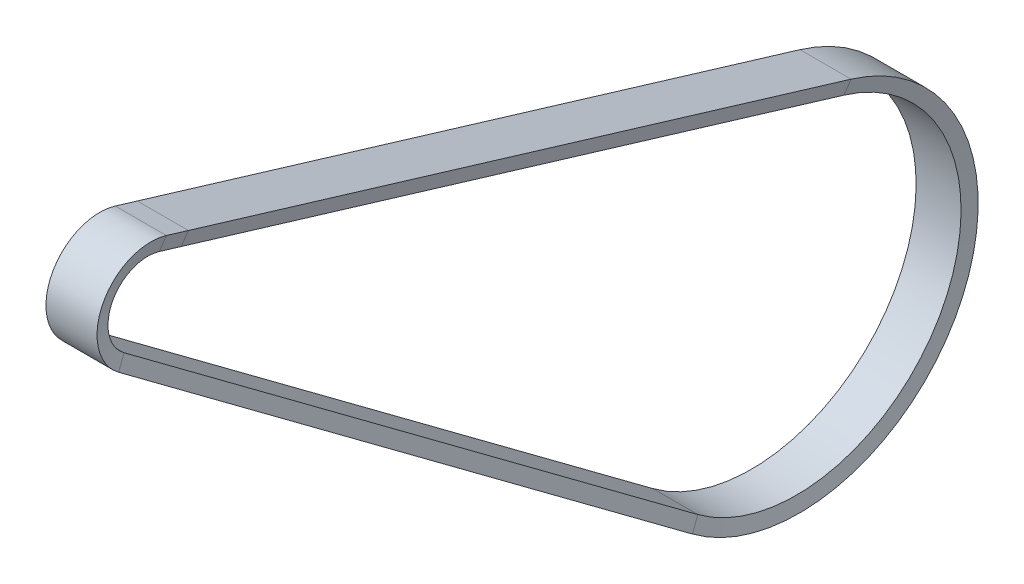
ISO-10303-21;
HEADER;
FILE_DESCRIPTION(('STEP AP214'),'2;1');
FILE_NAME('part.step','',(''),(''),'','','');
FILE_SCHEMA(('AUTOMOTIVE_DESIGN { 1 0 10303 214 1 1 1 1 }'));
ENDSEC;
DATA;
#1=APPLICATION_CONTEXT('core data for automotive mechanical design processes');
#2=APPLICATION_PROTOCOL_DEFINITION('international standard','automotive_design',2000,#1);
#3=PRODUCT_CONTEXT('',#1,'mechanical');
#4=PRODUCT('Part','Part','',(#3));
#5=PRODUCT_RELATED_PRODUCT_CATEGORY('part','',(#4));
#6=PRODUCT_DEFINITION_FORMATION('','',#4);
#7=PRODUCT_DEFINITION_CONTEXT('part definition',#1,'design');
#8=PRODUCT_DEFINITION('design','',#6,#7);
#9=PRODUCT_DEFINITION_SHAPE('','',#8);
#10=(LENGTH_UNIT() NAMED_UNIT(*) SI_UNIT(.MILLI.,.METRE.));
#11=(NAMED_UNIT(*) PLANE_ANGLE_UNIT() SI_UNIT($,.RADIAN.));
#12=(NAMED_UNIT(*) SI_UNIT($,.STERADIAN.) SOLID_ANGLE_UNIT());
#13=UNCERTAINTY_MEASURE_WITH_UNIT(LENGTH_MEASURE(1.E-05),#10,'distance_accuracy_value','');
#14=(GEOMETRIC_REPRESENTATION_CONTEXT(3) GLOBAL_UNCERTAINTY_ASSIGNED_CONTEXT((#13)) GLOBAL_UNIT_ASSIGNED_CONTEXT((#10,
#11,#12)) REPRESENTATION_CONTEXT('',''));
#15=CARTESIAN_POINT('',(0.,0.,0.));
#16=DIRECTION('',(0.,0.,1.));
#17=DIRECTION('',(1.,0.,0.));
#18=AXIS2_PLACEMENT_3D('',#15,#16,#17);
#19=CARTESIAN_POINT('',(8.355,85.4935565680425,-13.1454803731196));
#20=DIRECTION('',(-0.97666087498056,0.205603293377556,-0.0621355054257192));
#21=DIRECTION('',(-0.206001345113913,-0.978551708297144,0.));
#22=AXIS2_PLACEMENT_3D('',#19,#20,#21);
#23=PLANE('',#22);
#24=DIRECTION('',(0.214787186028604,0.934900240424163,-0.282538502106803));
#25=VECTOR('',#24,1.);
#26=CARTESIAN_POINT('',(8.355,85.4935565680425,-13.1454803731197));
#27=LINE('',#26,#25);
#28=CARTESIAN_POINT('',(8.355,85.4935565680425,-13.1454803731197));
#29=VERTEX_POINT('',#28);
#30=CARTESIAN_POINT('',(9.5002898876939,90.4786388309005,-14.6520343502457));
#31=VERTEX_POINT('',#30);
#32=EDGE_CURVE('E168',#29,#31,#27,.T.);
#33=ORIENTED_EDGE('',*,*,#32,.F.);
#34=DIRECTION('',(0.,-0.289288698150564,-0.957241896869518));
#35=VECTOR('',#34,1.);
#36=CARTESIAN_POINT('',(8.355,85.4935565680425,-13.1454803731196));
#37=LINE('',#36,#35);
#38=CARTESIAN_POINT('',(8.355,83.0173584034913,-21.3390967957916));
#39=VERTEX_POINT('',#38);
#40=EDGE_CURVE('E167',#29,#39,#37,.T.);
#41=ORIENTED_EDGE('',*,*,#40,.T.);
#42=DIRECTION('',(0.214787186028604,0.934900240424163,-0.282538502106803));
#43=VECTOR('',#42,1.);
#44=CARTESIAN_POINT('',(8.355,83.0173584034913,-21.3390967957916));
#45=LINE('',#44,#43);
#46=CARTESIAN_POINT('',(9.5002898876939,88.0024406663493,-22.8456507729176));
#47=VERTEX_POINT('',#46);
#48=EDGE_CURVE('E142',#39,#47,#45,.T.);
#49=ORIENTED_EDGE('',*,*,#48,.T.);
#50=DIRECTION('',(0.,-0.289288698150564,-0.957241896869518));
#51=VECTOR('',#50,1.);
#52=CARTESIAN_POINT('',(9.5002898876939,90.4786388309006,-14.6520343502457));
#53=LINE('',#52,#51);
#54=EDGE_CURVE('E172',#31,#47,#53,.T.);
#55=ORIENTED_EDGE('',*,*,#54,.F.);
#56=EDGE_LOOP('',(#33,#41,#49,#55));
#57=FACE_BOUND('',#56,.T.);
#58=ADVANCED_FACE('F34',(#57),#23,.F.);
#59=CARTESIAN_POINT('',(8.355,83.0173584034913,-21.3390967957916));
#60=DIRECTION('',(-0.97666087498056,0.205603293377556,-0.0621355054257192));
#61=DIRECTION('',(-0.206001345113913,-0.978551708297144,0.));
#62=AXIS2_PLACEMENT_3D('',#59,#60,#61);
#63=PLANE('',#62);
#64=DIRECTION('',(0.,-0.289288698150564,-0.957241896869518));
#65=VECTOR('',#64,1.);
#66=CARTESIAN_POINT('',(9.5002898876939,88.0024406663493,-22.8456507729176));
#67=LINE('',#66,#65);
#68=CARTESIAN_POINT('',(9.5002898876939,13.5386110579518,-269.242754974384));
#69=VERTEX_POINT('',#68);
#70=EDGE_CURVE('E148',#47,#69,#67,.T.);
#71=ORIENTED_EDGE('',*,*,#70,.F.);
#72=ORIENTED_EDGE('',*,*,#48,.F.);
#73=DIRECTION('',(0.,-0.289288698150564,-0.957241896869518));
#74=VECTOR('',#73,1.);
#75=CARTESIAN_POINT('',(8.355,83.0173584034913,-21.3390967957916));
#76=LINE('',#75,#74);
#77=CARTESIAN_POINT('',(8.355,8.55352879509376,-267.736200997258));
#78=VERTEX_POINT('',#77);
#79=EDGE_CURVE('E146',#39,#78,#76,.T.);
#80=ORIENTED_EDGE('',*,*,#79,.T.);
#81=DIRECTION('',(0.214787186028604,0.934900240424163,-0.282538502106803));
#82=VECTOR('',#81,1.);
#83=CARTESIAN_POINT('',(8.355,8.55352879509376,-267.736200997258));
#84=LINE('',#83,#82);
#85=EDGE_CURVE('E164',#78,#69,#84,.T.);
#86=ORIENTED_EDGE('',*,*,#85,.T.);
#87=EDGE_LOOP('',(#71,#72,#80,#86));
#88=FACE_BOUND('',#87,.T.);
#89=ADVANCED_FACE('F144',(#88),#63,.F.);
#90=CARTESIAN_POINT('',(9.5002898876939,88.0024406663493,-22.8456507729176));
#91=DIRECTION('',(0.,-0.957241896869518,0.289288698150564));
#92=DIRECTION('',(0.,-0.289288698150564,-0.957241896869518));
#93=AXIS2_PLACEMENT_3D('',#90,#91,#92);
#94=PLANE('',#93);
#95=DIRECTION('',(0.,-0.289288698150564,-0.957241896869518));
#96=VECTOR('',#95,1.);
#97=CARTESIAN_POINT('',(-9.4997101123061,88.0024406663493,-22.8456507729176));
#98=LINE('',#97,#96);
#99=CARTESIAN_POINT('',(-9.4997101123061,88.0024406663493,-22.8456507729176));
#100=VERTEX_POINT('',#99);
#101=CARTESIAN_POINT('',(-9.4997101123061,13.5386110579518,-269.242754974384));
#102=VERTEX_POINT('',#101);
#103=EDGE_CURVE('E209',#100,#102,#98,.T.);
#104=ORIENTED_EDGE('',*,*,#103,.F.);
#105=DIRECTION('',(-1.,0.,0.));
#106=VECTOR('',#105,1.);
#107=CARTESIAN_POINT('',(9.5002898876939,88.0024406663493,-22.8456507729176));
#108=LINE('',#107,#106);
#109=EDGE_CURVE('E153',#47,#100,#108,.T.);
#110=ORIENTED_EDGE('',*,*,#109,.F.);
#111=ORIENTED_EDGE('',*,*,#70,.T.);
#112=DIRECTION('',(-1.,0.,0.));
#113=VECTOR('',#112,1.);
#114=CARTESIAN_POINT('',(9.5002898876939,13.5386110579518,-269.242754974384));
#115=LINE('',#114,#113);
#116=EDGE_CURVE('E241',#69,#102,#115,.T.);
#117=ORIENTED_EDGE('',*,*,#116,.T.);
#118=EDGE_LOOP('',(#104,#110,#111,#117));
#119=FACE_BOUND('',#118,.T.);
#120=ADVANCED_FACE('F259',(#119),#94,.F.);
#121=CARTESIAN_POINT('',(-9.4997101123061,88.0024406663493,-22.8456507729176));
#122=DIRECTION('',(0.976683678934043,0.205504009848043,-0.0621055008854931));
#123=DIRECTION('',(-0.205901484103399,0.978572725373039,0.));
#124=AXIS2_PLACEMENT_3D('',#121,#122,#123);
#125=PLANE('',#124);
#126=DIRECTION('',(0.,-0.289288698150564,-0.957241896869518));
#127=VECTOR('',#126,1.);
#128=CARTESIAN_POINT('',(-8.355,83.0173584034913,-21.3390967957916));
#129=LINE('',#128,#127);
#130=CARTESIAN_POINT('',(-8.355,83.0173584034913,-21.3390967957916));
#131=VERTEX_POINT('',#130);
#132=CARTESIAN_POINT('',(-8.355,8.55352879509376,-267.736200997258));
#133=VERTEX_POINT('',#132);
#134=EDGE_CURVE('E183',#131,#133,#129,.T.);
#135=ORIENTED_EDGE('',*,*,#134,.F.);
#136=DIRECTION('',(0.214683467700105,-0.934922069312921,0.282545099068987));
#137=VECTOR('',#136,1.);
#138=CARTESIAN_POINT('',(-9.4997101123061,88.0024406663493,-22.8456507729176));
#139=LINE('',#138,#137);
#140=EDGE_CURVE('E175',#100,#131,#139,.T.);
#141=ORIENTED_EDGE('',*,*,#140,.F.);
#142=ORIENTED_EDGE('',*,*,#103,.T.);
#143=DIRECTION('',(0.214683467700105,-0.934922069312921,0.282545099068987));
#144=VECTOR('',#143,1.);
#145=CARTESIAN_POINT('',(-9.4997101123061,13.5386110579518,-269.242754974384));
#146=LINE('',#145,#144);
#147=EDGE_CURVE('E211',#102,#133,#146,.T.);
#148=ORIENTED_EDGE('',*,*,#147,.T.);
#149=EDGE_LOOP('',(#135,#141,#142,#148));
#150=FACE_BOUND('',#149,.T.);
#151=ADVANCED_FACE('F207',(#150),#125,.F.);
#152=CARTESIAN_POINT('',(-8.355,83.0173584034913,-21.3390967957916));
#153=DIRECTION('',(0.,0.957241896869518,-0.289288698150564));
#154=DIRECTION('',(0.,0.289288698150564,0.957241896869518));
#155=AXIS2_PLACEMENT_3D('',#152,#153,#154);
#156=PLANE('',#155);
#157=DIRECTION('',(1.,0.,0.));
#158=VECTOR('',#157,1.);
#159=CARTESIAN_POINT('',(-8.355,8.55352879509376,-267.736200997258));
#160=LINE('',#159,#158);
#161=EDGE_CURVE('E162',#133,#78,#160,.T.);
#162=ORIENTED_EDGE('',*,*,#161,.T.);
#163=ORIENTED_EDGE('',*,*,#79,.F.);
#164=DIRECTION('',(1.,0.,0.));
#165=VECTOR('',#164,1.);
#166=CARTESIAN_POINT('',(-8.355,83.0173584034913,-21.3390967957916));
#167=LINE('',#166,#165);
#168=EDGE_CURVE('E160',#131,#39,#167,.T.);
#169=ORIENTED_EDGE('',*,*,#168,.F.);
#170=ORIENTED_EDGE('',*,*,#134,.T.);
#171=EDGE_LOOP('',(#162,#163,#169,#170));
#172=FACE_BOUND('',#171,.T.);
#173=ADVANCED_FACE('F158',(#172),#156,.F.);
#174=CARTESIAN_POINT('',(8.355,-50.1332345006582,-250.000435974857));
#175=DIRECTION('',(1.,0.,0.));
#176=DIRECTION('',(0.,0.,-1.));
#177=AXIS2_PLACEMENT_3D('',#174,#175,#176);
#178=CONICAL_SURFACE('',#177,61.3081849923926,1.354322401732);
#179=CARTESIAN_POINT('',(9.5002898876939,-50.1332345006582,-250.000435974857));
#180=DIRECTION('',(-1.,0.,0.));
#181=DIRECTION('',(0.,0.957241859341531,-0.289288822328774));
#182=AXIS2_PLACEMENT_3D('',#179,#180,#181);
#183=CIRCLE('',#182,66.5159436324783);
#184=CARTESIAN_POINT('',(9.5002898876939,-103.494162302761,-210.289201526432));
#185=VERTEX_POINT('',#184);
#186=EDGE_CURVE('E127',#69,#185,#183,.T.);
#187=ORIENTED_EDGE('',*,*,#186,.F.);
#188=ORIENTED_EDGE('',*,*,#85,.F.);
#189=CARTESIAN_POINT('',(8.355,-50.1332345006582,-250.000435974857));
#190=DIRECTION('',(-1.,0.,0.));
#191=DIRECTION('',(0.,0.957241896869628,-0.289288698150197));
#192=AXIS2_PLACEMENT_3D('',#189,#190,#191);
#193=CIRCLE('',#192,61.3081849923926);
#194=CARTESIAN_POINT('',(8.355,-99.3163591807403,-213.39833502744));
#195=VERTEX_POINT('',#194);
#196=EDGE_CURVE('E182',#78,#195,#193,.T.);
#197=ORIENTED_EDGE('',*,*,#196,.T.);
#198=DIRECTION('',(0.214787186028604,-0.783503448342792,0.583085595048332));
#199=VECTOR('',#198,1.);
#200=CARTESIAN_POINT('',(8.355,-99.3163591807402,-213.39833502744));
#201=LINE('',#200,#199);
#202=EDGE_CURVE('E218',#195,#185,#201,.T.);
#203=ORIENTED_EDGE('',*,*,#202,.T.);
#204=EDGE_LOOP('',(#187,#188,#197,#203));
#205=FACE_BOUND('',#204,.T.);
#206=ADVANCED_FACE('F284',(#205),#178,.F.);
#207=CARTESIAN_POINT('',(0.,-50.1332345006582,-250.000435974857));
#208=DIRECTION('',(-1.,0.,0.));
#209=DIRECTION('',(0.,0.,1.));
#210=AXIS2_PLACEMENT_3D('',#207,#208,#209);
#211=CYLINDRICAL_SURFACE('',#210,66.5159436324783);
#212=CARTESIAN_POINT('',(-9.4997101123061,-50.1332345006582,-250.000435974857));
#213=DIRECTION('',(-1.,0.,0.));
#214=DIRECTION('',(0.,0.957241859341531,-0.289288822328774));
#215=AXIS2_PLACEMENT_3D('',#212,#213,#214);
#216=CIRCLE('',#215,66.5159436324783);
#217=CARTESIAN_POINT('',(-9.4997101123061,-103.494162302761,-210.289201526432));
#218=VERTEX_POINT('',#217);
#219=EDGE_CURVE('E121',#102,#218,#216,.T.);
#220=ORIENTED_EDGE('',*,*,#219,.F.);
#221=ORIENTED_EDGE('',*,*,#116,.F.);
#222=ORIENTED_EDGE('',*,*,#186,.T.);
#223=DIRECTION('',(-1.,0.,0.));
#224=VECTOR('',#223,1.);
#225=CARTESIAN_POINT('',(9.5002898876939,-103.494162302761,-210.289201526432));
#226=LINE('',#225,#224);
#227=EDGE_CURVE('E216',#185,#218,#226,.T.);
#228=ORIENTED_EDGE('',*,*,#227,.T.);
#229=EDGE_LOOP('',(#220,#221,#222,#228));
#230=FACE_BOUND('',#229,.T.);
#231=ADVANCED_FACE('F286',(#230),#211,.T.);
#232=CARTESIAN_POINT('',(-9.4997101123061,-50.1332345006582,-250.000435974857));
#233=DIRECTION('',(-1.,0.,0.));
#234=DIRECTION('',(0.,0.,1.));
#235=AXIS2_PLACEMENT_3D('',#232,#233,#234);
#236=CONICAL_SURFACE('',#235,66.5159436324783,1.35442859736266);
#237=CARTESIAN_POINT('',(-8.355,-50.1332345006582,-250.000435974857));
#238=DIRECTION('',(-1.,0.,0.));
#239=DIRECTION('',(0.,0.957241896869628,-0.289288698150197));
#240=AXIS2_PLACEMENT_3D('',#237,#238,#239);
#241=CIRCLE('',#240,61.3081849923926);
#242=CARTESIAN_POINT('',(-8.355,-99.3163591807403,-213.39833502744));
#243=VERTEX_POINT('',#242);
#244=EDGE_CURVE('E217',#133,#243,#241,.T.);
#245=ORIENTED_EDGE('',*,*,#244,.F.);
#246=ORIENTED_EDGE('',*,*,#147,.F.);
#247=ORIENTED_EDGE('',*,*,#219,.T.);
#248=DIRECTION('',(0.214683467700105,0.783521742283553,-0.583099209453421));
#249=VECTOR('',#248,1.);
#250=CARTESIAN_POINT('',(-9.4997101123061,-103.494162302761,-210.289201526432));
#251=LINE('',#250,#249);
#252=EDGE_CURVE('E187',#218,#243,#251,.T.);
#253=ORIENTED_EDGE('',*,*,#252,.T.);
#254=EDGE_LOOP('',(#245,#246,#247,#253));
#255=FACE_BOUND('',#254,.T.);
#256=ADVANCED_FACE('F292',(#255),#236,.F.);
#257=CARTESIAN_POINT('',(0.,-50.1332345006582,-250.000435974857));
#258=DIRECTION('',(-1.,0.,0.));
#259=DIRECTION('',(0.,0.,1.));
#260=AXIS2_PLACEMENT_3D('',#257,#258,#259);
#261=CYLINDRICAL_SURFACE('',#260,61.3081849923926);
#262=DIRECTION('',(1.,0.,0.));
#263=VECTOR('',#262,1.);
#264=CARTESIAN_POINT('',(-8.355,-99.3163591807402,-213.39833502744));
#265=LINE('',#264,#263);
#266=EDGE_CURVE('E184',#243,#195,#265,.T.);
#267=ORIENTED_EDGE('',*,*,#266,.T.);
#268=ORIENTED_EDGE('',*,*,#196,.F.);
#269=ORIENTED_EDGE('',*,*,#161,.F.);
#270=ORIENTED_EDGE('',*,*,#244,.T.);
#271=EDGE_LOOP('',(#267,#268,#269,#270));
#272=FACE_BOUND('',#271,.T.);
#273=ADVANCED_FACE('F282',(#272),#261,.F.);
#274=CARTESIAN_POINT('',(8.355,-99.3163591807402,-213.39833502744));
#275=DIRECTION('',(-0.97666087498056,-0.172308231787492,0.128231854624641));
#276=DIRECTION('',(0.173742613142672,-0.984791096821227,0.));
#277=AXIS2_PLACEMENT_3D('',#274,#275,#276);
#278=PLANE('',#277);
#279=DIRECTION('',(0.,0.597018178763213,0.802227707216758));
#280=VECTOR('',#279,1.);
#281=CARTESIAN_POINT('',(9.5002898876939,-103.494162302761,-210.289201526432));
#282=LINE('',#281,#280);
#283=CARTESIAN_POINT('',(9.5002898876939,55.2904551007498,3.07351353325508));
#284=VERTEX_POINT('',#283);
#285=EDGE_CURVE('E104',#185,#284,#282,.T.);
#286=ORIENTED_EDGE('',*,*,#285,.F.);
#287=ORIENTED_EDGE('',*,*,#202,.F.);
#288=DIRECTION('',(0.,0.597018178763213,0.802227707216758));
#289=VECTOR('',#288,1.);
#290=CARTESIAN_POINT('',(8.355,-99.3163591807402,-213.39833502744));
#291=LINE('',#290,#289);
#292=CARTESIAN_POINT('',(8.355,59.4682582227703,-0.0356199677531976));
#293=VERTEX_POINT('',#292);
#294=EDGE_CURVE('E186',#195,#293,#291,.T.);
#295=ORIENTED_EDGE('',*,*,#294,.T.);
#296=DIRECTION('',(0.214787186028604,-0.783503448342792,0.583085595048333));
#297=VECTOR('',#296,1.);
#298=CARTESIAN_POINT('',(8.355,59.4682582227703,-0.0356199677532046));
#299=LINE('',#298,#297);
#300=EDGE_CURVE('E247',#293,#284,#299,.T.);
#301=ORIENTED_EDGE('',*,*,#300,.T.);
#302=EDGE_LOOP('',(#286,#287,#295,#301));
#303=FACE_BOUND('',#302,.T.);
#304=ADVANCED_FACE('F278',(#303),#278,.F.);
#305=CARTESIAN_POINT('',(9.5002898876939,-103.494162302761,-210.289201526432));
#306=DIRECTION('',(0.,0.802227707216758,-0.597018178763213));
#307=DIRECTION('',(0.,0.597018178763213,0.802227707216758));
#308=AXIS2_PLACEMENT_3D('',#305,#306,#307);
#309=PLANE('',#308);
#310=DIRECTION('',(0.,0.597018178763213,0.802227707216758));
#311=VECTOR('',#310,1.);
#312=CARTESIAN_POINT('',(-9.4997101123061,-103.494162302761,-210.289201526432));
#313=LINE('',#312,#311);
#314=CARTESIAN_POINT('',(-9.4997101123061,55.2904551007498,3.07351353325508));
#315=VERTEX_POINT('',#314);
#316=EDGE_CURVE('E97',#218,#315,#313,.T.);
#317=ORIENTED_EDGE('',*,*,#316,.F.);
#318=ORIENTED_EDGE('',*,*,#227,.F.);
#319=ORIENTED_EDGE('',*,*,#285,.T.);
#320=DIRECTION('',(-1.,0.,0.));
#321=VECTOR('',#320,1.);
#322=CARTESIAN_POINT('',(9.5002898876939,55.2904551007498,3.07351353325509));
#323=LINE('',#322,#321);
#324=EDGE_CURVE('E226',#284,#315,#323,.T.);
#325=ORIENTED_EDGE('',*,*,#324,.T.);
#326=EDGE_LOOP('',(#317,#318,#319,#325));
#327=FACE_BOUND('',#326,.T.);
#328=ADVANCED_FACE('F281',(#327),#309,.F.);
#329=CARTESIAN_POINT('',(-9.4997101123061,-103.494162302761,-210.289201526432));
#330=DIRECTION('',(0.976683678934043,-0.172225026070623,0.128169932897055));
#331=DIRECTION('',(0.173657313172644,0.984806142132379,0.));
#332=AXIS2_PLACEMENT_3D('',#329,#330,#331);
#333=PLANE('',#332);
#334=DIRECTION('',(0.,0.597018178763213,0.802227707216758));
#335=VECTOR('',#334,1.);
#336=CARTESIAN_POINT('',(-8.355,-99.3163591807402,-213.39833502744));
#337=LINE('',#336,#335);
#338=CARTESIAN_POINT('',(-8.355,59.4682582227703,-0.0356199677531976));
#339=VERTEX_POINT('',#338);
#340=EDGE_CURVE('E88',#243,#339,#337,.T.);
#341=ORIENTED_EDGE('',*,*,#340,.F.);
#342=ORIENTED_EDGE('',*,*,#252,.F.);
#343=ORIENTED_EDGE('',*,*,#316,.T.);
#344=DIRECTION('',(0.214683467700105,0.783521742283552,-0.583099209453421));
#345=VECTOR('',#344,1.);
#346=CARTESIAN_POINT('',(-9.4997101123061,55.2904551007498,3.07351353325509));
#347=LINE('',#346,#345);
#348=EDGE_CURVE('E193',#315,#339,#347,.T.);
#349=ORIENTED_EDGE('',*,*,#348,.T.);
#350=EDGE_LOOP('',(#341,#342,#343,#349));
#351=FACE_BOUND('',#350,.T.);
#352=ADVANCED_FACE('F295',(#351),#333,.F.);
#353=CARTESIAN_POINT('',(-8.355,-99.3163591807402,-213.39833502744));
#354=DIRECTION('',(0.,-0.802227707216758,0.597018178763213));
#355=DIRECTION('',(0.,-0.597018178763213,-0.802227707216758));
#356=AXIS2_PLACEMENT_3D('',#353,#354,#355);
#357=PLANE('',#356);
#358=DIRECTION('',(1.,0.,0.));
#359=VECTOR('',#358,1.);
#360=CARTESIAN_POINT('',(-8.355,59.4682582227703,-0.0356199677532046));
#361=LINE('',#360,#359);
#362=EDGE_CURVE('E188',#339,#293,#361,.T.);
#363=ORIENTED_EDGE('',*,*,#362,.T.);
#364=ORIENTED_EDGE('',*,*,#294,.F.);
#365=ORIENTED_EDGE('',*,*,#266,.F.);
#366=ORIENTED_EDGE('',*,*,#340,.T.);
#367=EDGE_LOOP('',(#363,#364,#365,#366));
#368=FACE_BOUND('',#367,.T.);
#369=ADVANCED_FACE('F277',(#368),#357,.F.);
#370=CARTESIAN_POINT('',(8.355,71.3344566343139,-8.86644954487858));
#371=DIRECTION('',(1.,0.,0.));
#372=DIRECTION('',(0.,0.,-1.));
#373=AXIS2_PLACEMENT_3D('',#370,#371,#372);
#374=CONICAL_SURFACE('',#373,14.7915589361754,1.35432240173205);
#375=CARTESIAN_POINT('',(9.5002898876939,71.3344566343139,-8.86644954487858));
#376=DIRECTION('',(-1.,0.,0.));
#377=DIRECTION('',(0.,-0.802227449630928,0.597018524887341));
#378=AXIS2_PLACEMENT_3D('',#375,#376,#377);
#379=CIRCLE('',#378,19.9993175762624);
#380=EDGE_CURVE('E231',#284,#31,#379,.T.);
#381=ORIENTED_EDGE('',*,*,#380,.F.);
#382=ORIENTED_EDGE('',*,*,#300,.F.);
#383=CARTESIAN_POINT('',(8.355,71.3344566343139,-8.86644954487858));
#384=DIRECTION('',(-1.,0.,0.));
#385=DIRECTION('',(0.,-0.802227707217704,0.597018178761942));
#386=AXIS2_PLACEMENT_3D('',#383,#384,#385);
#387=CIRCLE('',#386,14.7915589361754);
#388=EDGE_CURVE('E189',#293,#29,#387,.T.);
#389=ORIENTED_EDGE('',*,*,#388,.T.);
#390=ORIENTED_EDGE('',*,*,#32,.T.);
#391=EDGE_LOOP('',(#381,#382,#389,#390));
#392=FACE_BOUND('',#391,.T.);
#393=ADVANCED_FACE('F274',(#392),#374,.F.);
#394=CARTESIAN_POINT('',(0.,71.3344566343139,-8.86644954487858));
#395=DIRECTION('',(-1.,0.,0.));
#396=DIRECTION('',(0.,0.,1.));
#397=AXIS2_PLACEMENT_3D('',#394,#395,#396);
#398=CYLINDRICAL_SURFACE('',#397,19.9993175762624);
#399=CARTESIAN_POINT('',(-9.4997101123061,71.3344566343139,-8.86644954487858));
#400=DIRECTION('',(-1.,0.,0.));
#401=DIRECTION('',(0.,-0.802227449630928,0.597018524887341));
#402=AXIS2_PLACEMENT_3D('',#399,#400,#401);
#403=CIRCLE('',#402,19.9993175762624);
#404=CARTESIAN_POINT('',(-9.4997101123061,90.4786388309005,-14.6520343502457));
#405=VERTEX_POINT('',#404);
#406=EDGE_CURVE('E59',#315,#405,#403,.T.);
#407=ORIENTED_EDGE('',*,*,#406,.F.);
#408=ORIENTED_EDGE('',*,*,#324,.F.);
#409=ORIENTED_EDGE('',*,*,#380,.T.);
#410=DIRECTION('',(-1.,0.,0.));
#411=VECTOR('',#410,1.);
#412=CARTESIAN_POINT('',(9.5002898876939,90.4786388309006,-14.6520343502457));
#413=LINE('',#412,#411);
#414=EDGE_CURVE('E229',#31,#405,#413,.T.);
#415=ORIENTED_EDGE('',*,*,#414,.T.);
#416=EDGE_LOOP('',(#407,#408,#409,#415));
#417=FACE_BOUND('',#416,.T.);
#418=ADVANCED_FACE('F255',(#417),#398,.T.);
#419=CARTESIAN_POINT('',(-9.4997101123061,71.3344566343139,-8.86644954487858));
#420=DIRECTION('',(-1.,0.,0.));
#421=DIRECTION('',(0.,0.,1.));
#422=AXIS2_PLACEMENT_3D('',#419,#420,#421);
#423=CONICAL_SURFACE('',#422,19.9993175762624,1.35442859736272);
#424=CARTESIAN_POINT('',(-8.355,71.3344566343139,-8.86644954487858));
#425=DIRECTION('',(-1.,0.,0.));
#426=DIRECTION('',(0.,-0.802227707217704,0.597018178761942));
#427=AXIS2_PLACEMENT_3D('',#424,#425,#426);
#428=CIRCLE('',#427,14.7915589361754);
#429=CARTESIAN_POINT('',(-8.355,85.4935565680425,-13.1454803731197));
#430=VERTEX_POINT('',#429);
#431=EDGE_CURVE('E51',#339,#430,#428,.T.);
#432=ORIENTED_EDGE('',*,*,#431,.F.);
#433=ORIENTED_EDGE('',*,*,#348,.F.);
#434=ORIENTED_EDGE('',*,*,#406,.T.);
#435=DIRECTION('',(0.214683467700105,-0.934922069312921,0.282545099068987));
#436=VECTOR('',#435,1.);
#437=CARTESIAN_POINT('',(-9.4997101123061,90.4786388309006,-14.6520343502457));
#438=LINE('',#437,#436);
#439=EDGE_CURVE('E198',#405,#430,#438,.T.);
#440=ORIENTED_EDGE('',*,*,#439,.T.);
#441=EDGE_LOOP('',(#432,#433,#434,#440));
#442=FACE_BOUND('',#441,.T.);
#443=ADVANCED_FACE('F304',(#442),#423,.F.);
#444=CARTESIAN_POINT('',(0.,71.3344566343139,-8.86644954487858));
#445=DIRECTION('',(-1.,0.,0.));
#446=DIRECTION('',(0.,0.,1.));
#447=AXIS2_PLACEMENT_3D('',#444,#445,#446);
#448=CYLINDRICAL_SURFACE('',#447,14.7915589361754);
#449=DIRECTION('',(1.,0.,0.));
#450=VECTOR('',#449,1.);
#451=CARTESIAN_POINT('',(-8.355,85.4935565680425,-13.1454803731197));
#452=LINE('',#451,#450);
#453=EDGE_CURVE('E38',#430,#29,#452,.T.);
#454=ORIENTED_EDGE('',*,*,#453,.T.);
#455=ORIENTED_EDGE('',*,*,#388,.F.);
#456=ORIENTED_EDGE('',*,*,#362,.F.);
#457=ORIENTED_EDGE('',*,*,#431,.T.);
#458=EDGE_LOOP('',(#454,#455,#456,#457));
#459=FACE_BOUND('',#458,.T.);
#460=ADVANCED_FACE('F199',(#459),#448,.F.);
#461=CARTESIAN_POINT('',(9.5002898876939,90.4786388309006,-14.6520343502457));
#462=DIRECTION('',(0.,-0.957241896869518,0.289288698150564));
#463=DIRECTION('',(0.,-0.289288698150564,-0.957241896869518));
#464=AXIS2_PLACEMENT_3D('',#461,#462,#463);
#465=PLANE('',#464);
#466=ORIENTED_EDGE('',*,*,#54,.T.);
#467=ORIENTED_EDGE('',*,*,#109,.T.);
#468=DIRECTION('',(0.,-0.289288698150564,-0.957241896869518));
#469=VECTOR('',#468,1.);
#470=CARTESIAN_POINT('',(-9.4997101123061,90.4786388309006,-14.6520343502457));
#471=LINE('',#470,#469);
#472=EDGE_CURVE('E43',#405,#100,#471,.T.);
#473=ORIENTED_EDGE('',*,*,#472,.F.);
#474=ORIENTED_EDGE('',*,*,#414,.F.);
#475=EDGE_LOOP('',(#466,#467,#473,#474));
#476=FACE_BOUND('',#475,.T.);
#477=ADVANCED_FACE('F258',(#476),#465,.F.);
#478=CARTESIAN_POINT('',(-9.4997101123061,90.4786388309006,-14.6520343502457));
#479=DIRECTION('',(0.976683678934043,0.205504009848043,-0.0621055008854931));
#480=DIRECTION('',(-0.205901484103399,0.978572725373039,0.));
#481=AXIS2_PLACEMENT_3D('',#478,#479,#480);
#482=PLANE('',#481);
#483=ORIENTED_EDGE('',*,*,#472,.T.);
#484=ORIENTED_EDGE('',*,*,#140,.T.);
#485=DIRECTION('',(0.,-0.289288698150564,-0.957241896869518));
#486=VECTOR('',#485,1.);
#487=CARTESIAN_POINT('',(-8.355,85.4935565680425,-13.1454803731196));
#488=LINE('',#487,#486);
#489=EDGE_CURVE('E11',#430,#131,#488,.T.);
#490=ORIENTED_EDGE('',*,*,#489,.F.);
#491=ORIENTED_EDGE('',*,*,#439,.F.);
#492=EDGE_LOOP('',(#483,#484,#490,#491));
#493=FACE_BOUND('',#492,.T.);
#494=ADVANCED_FACE('F203',(#493),#482,.F.);
#495=CARTESIAN_POINT('',(-8.355,85.4935565680425,-13.1454803731196));
#496=DIRECTION('',(0.,0.957241896869518,-0.289288698150564));
#497=DIRECTION('',(0.,0.289288698150564,0.957241896869518));
#498=AXIS2_PLACEMENT_3D('',#495,#496,#497);
#499=PLANE('',#498);
#500=ORIENTED_EDGE('',*,*,#489,.T.);
#501=ORIENTED_EDGE('',*,*,#168,.T.);
#502=ORIENTED_EDGE('',*,*,#40,.F.);
#503=ORIENTED_EDGE('',*,*,#453,.F.);
#504=EDGE_LOOP('',(#500,#501,#502,#503));
#505=FACE_BOUND('',#504,.T.);
#506=ADVANCED_FACE('F36',(#505),#499,.F.);
#507=CLOSED_SHELL('',(#58,#89,#120,#151,#173,#206,#231,#256,#273,#304,#328,#352,#369,#393,#418,
#443,#460,#477,#494,#506));
#508=MANIFOLD_SOLID_BREP('B2',#507);
#509=ADVANCED_BREP_SHAPE_REPRESENTATION('',(#18,#508),#14);
#510=SHAPE_DEFINITION_REPRESENTATION(#9,#509);
ENDSEC;
END-ISO-10303-21;
